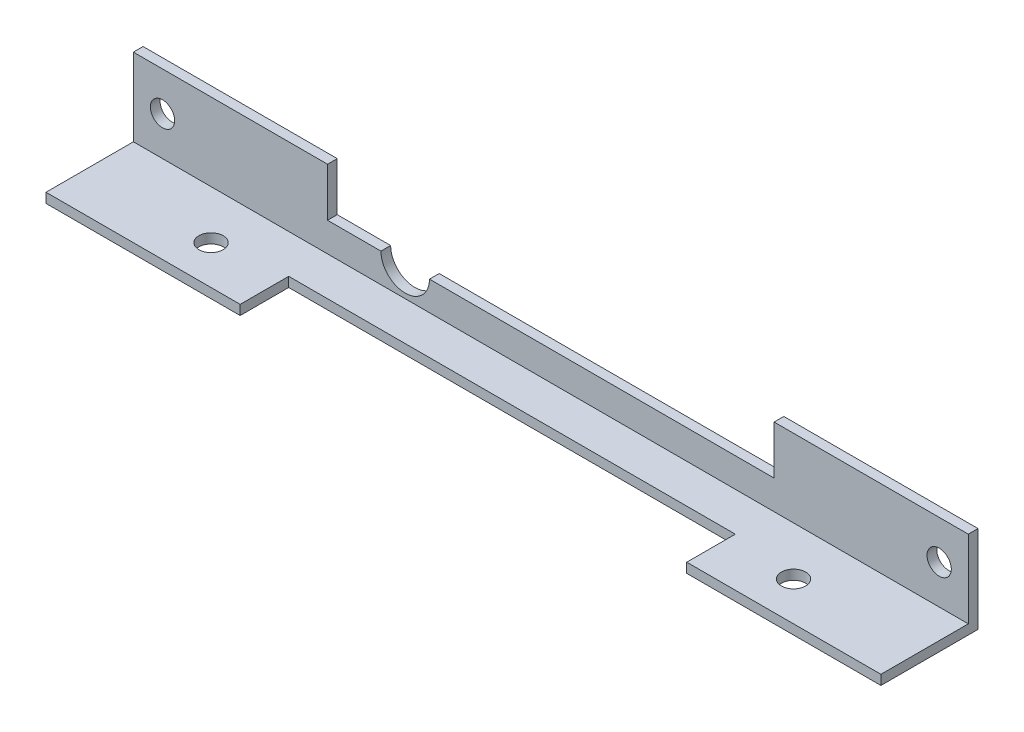
ISO-10303-21;
HEADER;
FILE_DESCRIPTION(('STEP AP214'),'2;1');
FILE_NAME('part.step','',(''),(''),'','','');
FILE_SCHEMA(('AUTOMOTIVE_DESIGN { 1 0 10303 214 1 1 1 1 }'));
ENDSEC;
DATA;
#1=APPLICATION_CONTEXT('core data for automotive mechanical design processes');
#2=APPLICATION_PROTOCOL_DEFINITION('international standard','automotive_design',2000,#1);
#3=PRODUCT_CONTEXT('',#1,'mechanical');
#4=PRODUCT('Part','Part','',(#3));
#5=PRODUCT_RELATED_PRODUCT_CATEGORY('part','',(#4));
#6=PRODUCT_DEFINITION_FORMATION('','',#4);
#7=PRODUCT_DEFINITION_CONTEXT('part definition',#1,'design');
#8=PRODUCT_DEFINITION('design','',#6,#7);
#9=PRODUCT_DEFINITION_SHAPE('','',#8);
#10=(LENGTH_UNIT() NAMED_UNIT(*) SI_UNIT(.MILLI.,.METRE.));
#11=(NAMED_UNIT(*) PLANE_ANGLE_UNIT() SI_UNIT($,.RADIAN.));
#12=(NAMED_UNIT(*) SI_UNIT($,.STERADIAN.) SOLID_ANGLE_UNIT());
#13=UNCERTAINTY_MEASURE_WITH_UNIT(LENGTH_MEASURE(1.E-05),#10,'distance_accuracy_value','');
#14=(GEOMETRIC_REPRESENTATION_CONTEXT(3) GLOBAL_UNCERTAINTY_ASSIGNED_CONTEXT((#13)) GLOBAL_UNIT_ASSIGNED_CONTEXT((#10,
#11,#12)) REPRESENTATION_CONTEXT('',''));
#15=CARTESIAN_POINT('',(0.,0.,0.));
#16=DIRECTION('',(0.,0.,1.));
#17=DIRECTION('',(1.,0.,0.));
#18=AXIS2_PLACEMENT_3D('',#15,#16,#17);
#19=CARTESIAN_POINT('',(-54.256880733945,4.,-19.8715596330275));
#20=DIRECTION('',(0.,-1.,0.));
#21=DIRECTION('',(0.,0.,-1.));
#22=AXIS2_PLACEMENT_3D('',#19,#20,#21);
#23=PLANE('',#22);
#24=DIRECTION('',(1.,0.,0.));
#25=VECTOR('',#24,1.);
#26=CARTESIAN_POINT('',(-74.256880733945,4.,-10.8715596330275));
#27=LINE('',#26,#25);
#28=CARTESIAN_POINT('',(-43.756880733945,4.,-10.8715596330275));
#29=VERTEX_POINT('',#28);
#30=CARTESIAN_POINT('',(-8.25688073394496,4.,-10.8715596330275));
#31=VERTEX_POINT('',#30);
#32=EDGE_CURVE('E164',#29,#31,#27,.T.);
#33=ORIENTED_EDGE('',*,*,#32,.F.);
#34=DIRECTION('',(0.,0.,1.));
#35=VECTOR('',#34,1.);
#36=CARTESIAN_POINT('',(-43.756880733945,4.,-19.8715596330275));
#37=LINE('',#36,#35);
#38=CARTESIAN_POINT('',(-43.756880733945,4.,-9.87155963302751));
#39=VERTEX_POINT('',#38);
#40=EDGE_CURVE('E11',#29,#39,#37,.T.);
#41=ORIENTED_EDGE('',*,*,#40,.T.);
#42=DIRECTION('',(1.,0.,0.));
#43=VECTOR('',#42,1.);
#44=CARTESIAN_POINT('',(-54.256880733945,4.,-9.87155963302751));
#45=LINE('',#44,#43);
#46=CARTESIAN_POINT('',(-8.25688073394496,4.,-9.87155963302751));
#47=VERTEX_POINT('',#46);
#48=EDGE_CURVE('E163',#39,#47,#45,.T.);
#49=ORIENTED_EDGE('',*,*,#48,.T.);
#50=DIRECTION('',(0.,0.,1.));
#51=VECTOR('',#50,1.);
#52=CARTESIAN_POINT('',(-8.25688073394496,4.,-19.8715596330275));
#53=LINE('',#52,#51);
#54=EDGE_CURVE('E181',#31,#47,#53,.T.);
#55=ORIENTED_EDGE('',*,*,#54,.F.);
#56=EDGE_LOOP('',(#33,#41,#49,#55));
#57=FACE_BOUND('',#56,.T.);
#58=ADVANCED_FACE('F39',(#57),#23,.F.);
#59=CARTESIAN_POINT('',(0.,9.,0.));
#60=DIRECTION('',(0.,1.,0.));
#61=DIRECTION('',(0.,0.,1.));
#62=AXIS2_PLACEMENT_3D('',#59,#60,#61);
#63=PLANE('',#62);
#64=DIRECTION('',(0.,0.,1.));
#65=VECTOR('',#64,1.);
#66=CARTESIAN_POINT('',(-54.256880733945,9.,0.));
#67=LINE('',#66,#65);
#68=CARTESIAN_POINT('',(-54.256880733945,9.,-10.8715596330275));
#69=VERTEX_POINT('',#68);
#70=CARTESIAN_POINT('',(-54.256880733945,9.,-9.87155963302751));
#71=VERTEX_POINT('',#70);
#72=EDGE_CURVE('E341',#69,#71,#67,.T.);
#73=ORIENTED_EDGE('',*,*,#72,.F.);
#74=DIRECTION('',(-1.,0.,0.));
#75=VECTOR('',#74,1.);
#76=CARTESIAN_POINT('',(-74.256880733945,9.,-10.8715596330275));
#77=LINE('',#76,#75);
#78=CARTESIAN_POINT('',(-74.256880733945,9.,-10.8715596330275));
#79=VERTEX_POINT('',#78);
#80=EDGE_CURVE('E262',#69,#79,#77,.T.);
#81=ORIENTED_EDGE('',*,*,#80,.T.);
#82=DIRECTION('',(0.,0.,1.));
#83=VECTOR('',#82,1.);
#84=CARTESIAN_POINT('',(-74.256880733945,9.,-10.8715596330275));
#85=LINE('',#84,#83);
#86=CARTESIAN_POINT('',(-74.256880733945,9.,-9.87155963302751));
#87=VERTEX_POINT('',#86);
#88=EDGE_CURVE('E249',#79,#87,#85,.T.);
#89=ORIENTED_EDGE('',*,*,#88,.T.);
#90=DIRECTION('',(1.,0.,0.));
#91=VECTOR('',#90,1.);
#92=CARTESIAN_POINT('',(-74.256880733945,9.,-9.87155963302751));
#93=LINE('',#92,#91);
#94=EDGE_CURVE('E254',#87,#71,#93,.T.);
#95=ORIENTED_EDGE('',*,*,#94,.T.);
#96=EDGE_LOOP('',(#73,#81,#89,#95));
#97=FACE_BOUND('',#96,.T.);
#98=ADVANCED_FACE('F358',(#97),#63,.T.);
#99=CARTESIAN_POINT('',(-74.256880733945,1.,-0.871559633027515));
#100=DIRECTION('',(0.,0.,-1.));
#101=DIRECTION('',(-1.,0.,0.));
#102=AXIS2_PLACEMENT_3D('',#99,#100,#101);
#103=PLANE('',#102);
#104=DIRECTION('',(1.,0.,0.));
#105=VECTOR('',#104,1.);
#106=CARTESIAN_POINT('',(-74.256880733945,0.,-0.871559633027515));
#107=LINE('',#106,#105);
#108=CARTESIAN_POINT('',(-74.256880733945,0.,-0.871559633027515));
#109=VERTEX_POINT('',#108);
#110=CARTESIAN_POINT('',(-54.256880733945,0.,-0.871559633027515));
#111=VERTEX_POINT('',#110);
#112=EDGE_CURVE('E296',#109,#111,#107,.T.);
#113=ORIENTED_EDGE('',*,*,#112,.T.);
#114=DIRECTION('',(0.,1.,0.));
#115=VECTOR('',#114,1.);
#116=CARTESIAN_POINT('',(-54.256880733945,-9.,-0.871559633027515));
#117=LINE('',#116,#115);
#118=CARTESIAN_POINT('',(-54.256880733945,1.,-0.871559633027515));
#119=VERTEX_POINT('',#118);
#120=EDGE_CURVE('E209',#111,#119,#117,.T.);
#121=ORIENTED_EDGE('',*,*,#120,.T.);
#122=DIRECTION('',(1.,0.,0.));
#123=VECTOR('',#122,1.);
#124=CARTESIAN_POINT('',(-74.256880733945,1.,-0.871559633027515));
#125=LINE('',#124,#123);
#126=CARTESIAN_POINT('',(-74.256880733945,1.,-0.871559633027515));
#127=VERTEX_POINT('',#126);
#128=EDGE_CURVE('E284',#127,#119,#125,.T.);
#129=ORIENTED_EDGE('',*,*,#128,.F.);
#130=DIRECTION('',(0.,-1.,0.));
#131=VECTOR('',#130,1.);
#132=CARTESIAN_POINT('',(-74.256880733945,1.,-0.871559633027515));
#133=LINE('',#132,#131);
#134=EDGE_CURVE('E316',#127,#109,#133,.T.);
#135=ORIENTED_EDGE('',*,*,#134,.T.);
#136=EDGE_LOOP('',(#113,#121,#129,#135));
#137=FACE_BOUND('',#136,.T.);
#138=ADVANCED_FACE('F371',(#137),#103,.F.);
#139=CARTESIAN_POINT('',(-74.256880733945,1.,-10.8715596330275));
#140=DIRECTION('',(1.,0.,0.));
#141=DIRECTION('',(0.,0.,-1.));
#142=AXIS2_PLACEMENT_3D('',#139,#140,#141);
#143=PLANE('',#142);
#144=DIRECTION('',(0.,0.,1.));
#145=VECTOR('',#144,1.);
#146=CARTESIAN_POINT('',(-74.256880733945,0.,-10.8715596330275));
#147=LINE('',#146,#145);
#148=CARTESIAN_POINT('',(-74.256880733945,0.,-10.8715596330275));
#149=VERTEX_POINT('',#148);
#150=EDGE_CURVE('E278',#149,#109,#147,.T.);
#151=ORIENTED_EDGE('',*,*,#150,.T.);
#152=ORIENTED_EDGE('',*,*,#134,.F.);
#153=DIRECTION('',(0.,0.,1.));
#154=VECTOR('',#153,1.);
#155=CARTESIAN_POINT('',(-74.256880733945,1.,-10.8715596330275));
#156=LINE('',#155,#154);
#157=CARTESIAN_POINT('',(-74.256880733945,1.,-9.87155963302751));
#158=VERTEX_POINT('',#157);
#159=EDGE_CURVE('E279',#158,#127,#156,.T.);
#160=ORIENTED_EDGE('',*,*,#159,.F.);
#161=DIRECTION('',(0.,-1.,0.));
#162=VECTOR('',#161,1.);
#163=CARTESIAN_POINT('',(-74.256880733945,9.,-9.87155963302751));
#164=LINE('',#163,#162);
#165=EDGE_CURVE('E274',#87,#158,#164,.T.);
#166=ORIENTED_EDGE('',*,*,#165,.F.);
#167=ORIENTED_EDGE('',*,*,#88,.F.);
#168=DIRECTION('',(0.,-1.,0.));
#169=VECTOR('',#168,1.);
#170=CARTESIAN_POINT('',(-74.256880733945,1.,-10.8715596330275));
#171=LINE('',#170,#169);
#172=EDGE_CURVE('E291',#79,#149,#171,.T.);
#173=ORIENTED_EDGE('',*,*,#172,.T.);
#174=EDGE_LOOP('',(#151,#152,#160,#166,#167,#173));
#175=FACE_BOUND('',#174,.T.);
#176=ADVANCED_FACE('F41',(#175),#143,.F.);
#177=CARTESIAN_POINT('',(-8.25688073394496,1.,-0.871559633027515));
#178=VERTEX_POINT('',#177);
#179=CARTESIAN_POINT('',(11.743119266055,1.,-0.871559633027515));
#180=VERTEX_POINT('',#179);
#181=EDGE_CURVE('E282',#178,#180,#125,.T.);
#182=ORIENTED_EDGE('',*,*,#181,.F.);
#183=DIRECTION('',(0.,1.,0.));
#184=VECTOR('',#183,1.);
#185=CARTESIAN_POINT('',(-8.25688073394496,-9.,-0.871559633027515));
#186=LINE('',#185,#184);
#187=CARTESIAN_POINT('',(-8.25688073394496,0.,-0.871559633027515));
#188=VERTEX_POINT('',#187);
#189=EDGE_CURVE('E217',#188,#178,#186,.T.);
#190=ORIENTED_EDGE('',*,*,#189,.F.);
#191=CARTESIAN_POINT('',(11.743119266055,0.,-0.871559633027515));
#192=VERTEX_POINT('',#191);
#193=EDGE_CURVE('E295',#188,#192,#107,.T.);
#194=ORIENTED_EDGE('',*,*,#193,.T.);
#195=DIRECTION('',(0.,-1.,0.));
#196=VECTOR('',#195,1.);
#197=CARTESIAN_POINT('',(11.743119266055,1.,-0.871559633027515));
#198=LINE('',#197,#196);
#199=EDGE_CURVE('E312',#180,#192,#198,.T.);
#200=ORIENTED_EDGE('',*,*,#199,.F.);
#201=EDGE_LOOP('',(#182,#190,#194,#200));
#202=FACE_BOUND('',#201,.T.);
#203=ADVANCED_FACE('F389',(#202),#103,.F.);
#204=CARTESIAN_POINT('',(11.743119266055,1.,-10.8715596330275));
#205=DIRECTION('',(-1.,0.,0.));
#206=DIRECTION('',(0.,0.,1.));
#207=AXIS2_PLACEMENT_3D('',#204,#205,#206);
#208=PLANE('',#207);
#209=DIRECTION('',(0.,0.,-1.));
#210=VECTOR('',#209,1.);
#211=CARTESIAN_POINT('',(11.743119266055,0.,-10.8715596330275));
#212=LINE('',#211,#210);
#213=CARTESIAN_POINT('',(11.743119266055,0.,-10.8715596330275));
#214=VERTEX_POINT('',#213);
#215=EDGE_CURVE('E300',#192,#214,#212,.T.);
#216=ORIENTED_EDGE('',*,*,#215,.T.);
#217=DIRECTION('',(0.,-1.,0.));
#218=VECTOR('',#217,1.);
#219=CARTESIAN_POINT('',(11.743119266055,1.,-10.8715596330275));
#220=LINE('',#219,#218);
#221=CARTESIAN_POINT('',(11.743119266055,9.,-10.8715596330275));
#222=VERTEX_POINT('',#221);
#223=EDGE_CURVE('E308',#222,#214,#220,.T.);
#224=ORIENTED_EDGE('',*,*,#223,.F.);
#225=DIRECTION('',(0.,0.,-1.));
#226=VECTOR('',#225,1.);
#227=CARTESIAN_POINT('',(11.743119266055,9.,-10.8715596330275));
#228=LINE('',#227,#226);
#229=CARTESIAN_POINT('',(11.743119266055,9.,-9.87155963302751));
#230=VERTEX_POINT('',#229);
#231=EDGE_CURVE('E258',#230,#222,#228,.T.);
#232=ORIENTED_EDGE('',*,*,#231,.F.);
#233=DIRECTION('',(0.,-1.,0.));
#234=VECTOR('',#233,1.);
#235=CARTESIAN_POINT('',(11.743119266055,9.,-9.87155963302751));
#236=LINE('',#235,#234);
#237=CARTESIAN_POINT('',(11.743119266055,1.,-9.87155963302751));
#238=VERTEX_POINT('',#237);
#239=EDGE_CURVE('E267',#230,#238,#236,.T.);
#240=ORIENTED_EDGE('',*,*,#239,.T.);
#241=DIRECTION('',(0.,0.,-1.));
#242=VECTOR('',#241,1.);
#243=CARTESIAN_POINT('',(11.743119266055,1.,-10.8715596330275));
#244=LINE('',#243,#242);
#245=EDGE_CURVE('E288',#180,#238,#244,.T.);
#246=ORIENTED_EDGE('',*,*,#245,.F.);
#247=ORIENTED_EDGE('',*,*,#199,.T.);
#248=EDGE_LOOP('',(#216,#224,#232,#240,#246,#247));
#249=FACE_BOUND('',#248,.T.);
#250=ADVANCED_FACE('F443',(#249),#208,.F.);
#251=CARTESIAN_POINT('',(-74.256880733945,1.,-10.8715596330275));
#252=DIRECTION('',(0.,0.,1.));
#253=DIRECTION('',(1.,0.,0.));
#254=AXIS2_PLACEMENT_3D('',#251,#252,#253);
#255=PLANE('',#254);
#256=CARTESIAN_POINT('',(-54.256880733945,4.,-10.8715596330275));
#257=VERTEX_POINT('',#256);
#258=CARTESIAN_POINT('',(-48.756880733945,4.,-10.8715596330275));
#259=VERTEX_POINT('',#258);
#260=EDGE_CURVE('E194',#257,#259,#27,.T.);
#261=ORIENTED_EDGE('',*,*,#260,.T.);
#262=CARTESIAN_POINT('',(-46.256880733945,4.,-10.8715596330275));
#263=DIRECTION('',(0.,0.,1.));
#264=DIRECTION('',(1.,0.,0.));
#265=AXIS2_PLACEMENT_3D('',#262,#263,#264);
#266=CIRCLE('',#265,2.5);
#267=EDGE_CURVE('E55',#259,#29,#266,.T.);
#268=ORIENTED_EDGE('',*,*,#267,.T.);
#269=ORIENTED_EDGE('',*,*,#32,.T.);
#270=DIRECTION('',(0.,1.,0.));
#271=VECTOR('',#270,1.);
#272=CARTESIAN_POINT('',(-8.25688073394496,1.,-10.8715596330275));
#273=LINE('',#272,#271);
#274=CARTESIAN_POINT('',(-8.25688073394496,9.,-10.8715596330275));
#275=VERTEX_POINT('',#274);
#276=EDGE_CURVE('E184',#31,#275,#273,.T.);
#277=ORIENTED_EDGE('',*,*,#276,.T.);
#278=EDGE_CURVE('E263',#222,#275,#77,.T.);
#279=ORIENTED_EDGE('',*,*,#278,.F.);
#280=ORIENTED_EDGE('',*,*,#223,.T.);
#281=DIRECTION('',(-1.,0.,0.));
#282=VECTOR('',#281,1.);
#283=CARTESIAN_POINT('',(-74.256880733945,0.,-10.8715596330275));
#284=LINE('',#283,#282);
#285=EDGE_CURVE('E283',#214,#149,#284,.T.);
#286=ORIENTED_EDGE('',*,*,#285,.T.);
#287=ORIENTED_EDGE('',*,*,#172,.F.);
#288=ORIENTED_EDGE('',*,*,#80,.F.);
#289=DIRECTION('',(0.,-1.,0.));
#290=VECTOR('',#289,1.);
#291=CARTESIAN_POINT('',(-54.256880733945,0.999999999999972,-10.8715596330275));
#292=LINE('',#291,#290);
#293=EDGE_CURVE('E190',#69,#257,#292,.T.);
#294=ORIENTED_EDGE('',*,*,#293,.T.);
#295=EDGE_LOOP('',(#261,#268,#269,#277,#279,#280,#286,#287,#288,#294));
#296=FACE_BOUND('',#295,.T.);
#297=CARTESIAN_POINT('',(8.74311926605504,5.,-10.8715596330275));
#298=DIRECTION('',(0.,0.,1.));
#299=DIRECTION('',(1.,0.,0.));
#300=AXIS2_PLACEMENT_3D('',#297,#298,#299);
#301=CIRCLE('',#300,1.25);
#302=CARTESIAN_POINT('',(9.99311926605504,5.,-10.8715596330275));
#303=VERTEX_POINT('',#302);
#304=EDGE_CURVE('E244',#303,#303,#301,.T.);
#305=ORIENTED_EDGE('',*,*,#304,.T.);
#306=EDGE_LOOP('',(#305));
#307=FACE_BOUND('',#306,.T.);
#308=CARTESIAN_POINT('',(-71.256880733945,5.,-10.8715596330275));
#309=DIRECTION('',(0.,0.,1.));
#310=DIRECTION('',(1.,0.,0.));
#311=AXIS2_PLACEMENT_3D('',#308,#309,#310);
#312=CIRCLE('',#311,1.25);
#313=CARTESIAN_POINT('',(-70.006880733945,5.,-10.8715596330275));
#314=VERTEX_POINT('',#313);
#315=EDGE_CURVE('E235',#314,#314,#312,.T.);
#316=ORIENTED_EDGE('',*,*,#315,.T.);
#317=EDGE_LOOP('',(#316));
#318=FACE_BOUND('',#317,.T.);
#319=ADVANCED_FACE('F349',(#296,#307,#318),#255,.F.);
#320=CARTESIAN_POINT('',(0.,1.,0.));
#321=DIRECTION('',(0.,1.,0.));
#322=DIRECTION('',(0.,0.,1.));
#323=AXIS2_PLACEMENT_3D('',#320,#321,#322);
#324=PLANE('',#323);
#325=DIRECTION('',(0.,0.,1.));
#326=VECTOR('',#325,1.);
#327=CARTESIAN_POINT('',(-54.256880733945,1.,-5.87155963302752));
#328=LINE('',#327,#326);
#329=CARTESIAN_POINT('',(-54.256880733945,1.,-5.87155963302752));
#330=VERTEX_POINT('',#329);
#331=EDGE_CURVE('E198',#330,#119,#328,.T.);
#332=ORIENTED_EDGE('',*,*,#331,.F.);
#333=DIRECTION('',(-1.,0.,0.));
#334=VECTOR('',#333,1.);
#335=CARTESIAN_POINT('',(-54.256880733945,1.,-5.87155963302752));
#336=LINE('',#335,#334);
#337=CARTESIAN_POINT('',(-8.25688073394496,1.,-5.87155963302752));
#338=VERTEX_POINT('',#337);
#339=EDGE_CURVE('E205',#338,#330,#336,.T.);
#340=ORIENTED_EDGE('',*,*,#339,.F.);
#341=DIRECTION('',(0.,0.,-1.));
#342=VECTOR('',#341,1.);
#343=CARTESIAN_POINT('',(-8.25688073394496,1.,-5.87155963302752));
#344=LINE('',#343,#342);
#345=EDGE_CURVE('E201',#178,#338,#344,.T.);
#346=ORIENTED_EDGE('',*,*,#345,.F.);
#347=ORIENTED_EDGE('',*,*,#181,.T.);
#348=ORIENTED_EDGE('',*,*,#245,.T.);
#349=DIRECTION('',(1.,0.,0.));
#350=VECTOR('',#349,1.);
#351=CARTESIAN_POINT('',(-74.256880733945,1.,-9.87155963302751));
#352=LINE('',#351,#350);
#353=EDGE_CURVE('E248',#158,#238,#352,.T.);
#354=ORIENTED_EDGE('',*,*,#353,.F.);
#355=ORIENTED_EDGE('',*,*,#159,.T.);
#356=ORIENTED_EDGE('',*,*,#128,.T.);
#357=EDGE_LOOP('',(#332,#340,#346,#347,#348,#354,#355,#356));
#358=FACE_BOUND('',#357,.T.);
#359=CARTESIAN_POINT('',(-61.256880733945,1.,-4.87155963302752));
#360=DIRECTION('',(0.,1.,0.));
#361=DIRECTION('',(0.,0.,1.));
#362=AXIS2_PLACEMENT_3D('',#359,#360,#361);
#363=CIRCLE('',#362,1.25);
#364=CARTESIAN_POINT('',(-61.256880733945,1.,-3.62155963302752));
#365=VERTEX_POINT('',#364);
#366=EDGE_CURVE('E223',#365,#365,#363,.T.);
#367=ORIENTED_EDGE('',*,*,#366,.F.);
#368=EDGE_LOOP('',(#367));
#369=FACE_BOUND('',#368,.T.);
#370=CARTESIAN_POINT('',(-1.25688073394496,1.,-4.87155963302752));
#371=DIRECTION('',(0.,1.,0.));
#372=DIRECTION('',(0.,0.,1.));
#373=AXIS2_PLACEMENT_3D('',#370,#371,#372);
#374=CIRCLE('',#373,1.25);
#375=CARTESIAN_POINT('',(-1.25688073394496,1.,-3.62155963302751));
#376=VERTEX_POINT('',#375);
#377=EDGE_CURVE('E213',#376,#376,#374,.T.);
#378=ORIENTED_EDGE('',*,*,#377,.F.);
#379=EDGE_LOOP('',(#378));
#380=FACE_BOUND('',#379,.T.);
#381=ADVANCED_FACE('F368',(#358,#369,#380),#324,.T.);
#382=CARTESIAN_POINT('',(0.,0.,0.));
#383=DIRECTION('',(0.,1.,0.));
#384=DIRECTION('',(0.,0.,1.));
#385=AXIS2_PLACEMENT_3D('',#382,#383,#384);
#386=PLANE('',#385);
#387=CARTESIAN_POINT('',(-61.256880733945,0.,-4.87155963302752));
#388=DIRECTION('',(0.,1.,0.));
#389=DIRECTION('',(0.,0.,1.));
#390=AXIS2_PLACEMENT_3D('',#387,#388,#389);
#391=CIRCLE('',#390,1.25);
#392=CARTESIAN_POINT('',(-61.256880733945,0.,-3.62155963302752));
#393=VERTEX_POINT('',#392);
#394=EDGE_CURVE('E240',#393,#393,#391,.T.);
#395=ORIENTED_EDGE('',*,*,#394,.T.);
#396=EDGE_LOOP('',(#395));
#397=FACE_BOUND('',#396,.T.);
#398=CARTESIAN_POINT('',(-1.25688073394496,0.,-4.87155963302752));
#399=DIRECTION('',(0.,1.,0.));
#400=DIRECTION('',(0.,0.,1.));
#401=AXIS2_PLACEMENT_3D('',#398,#399,#400);
#402=CIRCLE('',#401,1.25);
#403=CARTESIAN_POINT('',(-1.25688073394496,0.,-3.62155963302751));
#404=VERTEX_POINT('',#403);
#405=EDGE_CURVE('E227',#404,#404,#402,.T.);
#406=ORIENTED_EDGE('',*,*,#405,.T.);
#407=EDGE_LOOP('',(#406));
#408=FACE_BOUND('',#407,.T.);
#409=DIRECTION('',(-1.,0.,0.));
#410=VECTOR('',#409,1.);
#411=CARTESIAN_POINT('',(0.,0.,-5.87155963302752));
#412=LINE('',#411,#410);
#413=CARTESIAN_POINT('',(-8.25688073394496,0.,-5.87155963302752));
#414=VERTEX_POINT('',#413);
#415=CARTESIAN_POINT('',(-54.256880733945,0.,-5.87155963302752));
#416=VERTEX_POINT('',#415);
#417=EDGE_CURVE('E330',#414,#416,#412,.T.);
#418=ORIENTED_EDGE('',*,*,#417,.T.);
#419=DIRECTION('',(0.,0.,1.));
#420=VECTOR('',#419,1.);
#421=CARTESIAN_POINT('',(-54.256880733945,0.,0.));
#422=LINE('',#421,#420);
#423=EDGE_CURVE('E334',#416,#111,#422,.T.);
#424=ORIENTED_EDGE('',*,*,#423,.T.);
#425=ORIENTED_EDGE('',*,*,#112,.F.);
#426=ORIENTED_EDGE('',*,*,#150,.F.);
#427=ORIENTED_EDGE('',*,*,#285,.F.);
#428=ORIENTED_EDGE('',*,*,#215,.F.);
#429=ORIENTED_EDGE('',*,*,#193,.F.);
#430=DIRECTION('',(0.,0.,-1.));
#431=VECTOR('',#430,1.);
#432=CARTESIAN_POINT('',(-8.25688073394496,0.,0.));
#433=LINE('',#432,#431);
#434=EDGE_CURVE('E320',#188,#414,#433,.T.);
#435=ORIENTED_EDGE('',*,*,#434,.T.);
#436=EDGE_LOOP('',(#418,#424,#425,#426,#427,#428,#429,#435));
#437=FACE_BOUND('',#436,.T.);
#438=ADVANCED_FACE('F376',(#397,#408,#437),#386,.F.);
#439=CARTESIAN_POINT('',(-74.256880733945,9.,-9.87155963302751));
#440=DIRECTION('',(0.,0.,-1.));
#441=DIRECTION('',(-1.,0.,0.));
#442=AXIS2_PLACEMENT_3D('',#439,#440,#441);
#443=PLANE('',#442);
#444=CARTESIAN_POINT('',(8.74311926605504,5.,-9.87155963302751));
#445=DIRECTION('',(0.,0.,1.));
#446=DIRECTION('',(1.,0.,0.));
#447=AXIS2_PLACEMENT_3D('',#444,#445,#446);
#448=CIRCLE('',#447,1.25);
#449=CARTESIAN_POINT('',(9.99311926605504,5.,-9.87155963302751));
#450=VERTEX_POINT('',#449);
#451=EDGE_CURVE('E231',#450,#450,#448,.T.);
#452=ORIENTED_EDGE('',*,*,#451,.F.);
#453=EDGE_LOOP('',(#452));
#454=FACE_BOUND('',#453,.T.);
#455=CARTESIAN_POINT('',(-71.256880733945,5.,-9.87155963302751));
#456=DIRECTION('',(0.,0.,1.));
#457=DIRECTION('',(1.,0.,0.));
#458=AXIS2_PLACEMENT_3D('',#455,#456,#457);
#459=CIRCLE('',#458,1.25);
#460=CARTESIAN_POINT('',(-70.006880733945,5.,-9.87155963302751));
#461=VERTEX_POINT('',#460);
#462=EDGE_CURVE('E236',#461,#461,#459,.T.);
#463=ORIENTED_EDGE('',*,*,#462,.F.);
#464=EDGE_LOOP('',(#463));
#465=FACE_BOUND('',#464,.T.);
#466=ORIENTED_EDGE('',*,*,#48,.F.);
#467=CARTESIAN_POINT('',(-46.256880733945,4.,-9.87155963302751));
#468=DIRECTION('',(0.,0.,1.));
#469=DIRECTION('',(1.,0.,0.));
#470=AXIS2_PLACEMENT_3D('',#467,#468,#469);
#471=CIRCLE('',#470,2.5);
#472=CARTESIAN_POINT('',(-48.756880733945,4.,-9.87155963302751));
#473=VERTEX_POINT('',#472);
#474=EDGE_CURVE('E152',#473,#39,#471,.T.);
#475=ORIENTED_EDGE('',*,*,#474,.F.);
#476=CARTESIAN_POINT('',(-54.256880733945,4.,-9.87155963302751));
#477=VERTEX_POINT('',#476);
#478=EDGE_CURVE('E168',#477,#473,#45,.T.);
#479=ORIENTED_EDGE('',*,*,#478,.F.);
#480=DIRECTION('',(0.,-1.,0.));
#481=VECTOR('',#480,1.);
#482=CARTESIAN_POINT('',(-54.256880733945,9.,-9.87155963302751));
#483=LINE('',#482,#481);
#484=EDGE_CURVE('E169',#71,#477,#483,.T.);
#485=ORIENTED_EDGE('',*,*,#484,.F.);
#486=ORIENTED_EDGE('',*,*,#94,.F.);
#487=ORIENTED_EDGE('',*,*,#165,.T.);
#488=ORIENTED_EDGE('',*,*,#353,.T.);
#489=ORIENTED_EDGE('',*,*,#239,.F.);
#490=CARTESIAN_POINT('',(-8.25688073394496,9.,-9.87155963302751));
#491=VERTEX_POINT('',#490);
#492=EDGE_CURVE('E253',#491,#230,#93,.T.);
#493=ORIENTED_EDGE('',*,*,#492,.F.);
#494=DIRECTION('',(0.,1.,0.));
#495=VECTOR('',#494,1.);
#496=CARTESIAN_POINT('',(-8.25688073394496,9.,-9.87155963302751));
#497=LINE('',#496,#495);
#498=EDGE_CURVE('E63',#47,#491,#497,.T.);
#499=ORIENTED_EDGE('',*,*,#498,.F.);
#500=EDGE_LOOP('',(#466,#475,#479,#485,#486,#487,#488,#489,#493,#499));
#501=FACE_BOUND('',#500,.T.);
#502=ADVANCED_FACE('F165',(#454,#465,#501),#443,.F.);
#503=DIRECTION('',(0.,0.,-1.));
#504=VECTOR('',#503,1.);
#505=CARTESIAN_POINT('',(-8.25688073394496,9.,0.));
#506=LINE('',#505,#504);
#507=EDGE_CURVE('E338',#491,#275,#506,.T.);
#508=ORIENTED_EDGE('',*,*,#507,.F.);
#509=ORIENTED_EDGE('',*,*,#492,.T.);
#510=ORIENTED_EDGE('',*,*,#231,.T.);
#511=ORIENTED_EDGE('',*,*,#278,.T.);
#512=EDGE_LOOP('',(#508,#509,#510,#511));
#513=FACE_BOUND('',#512,.T.);
#514=ADVANCED_FACE('F440',(#513),#63,.T.);
#515=CARTESIAN_POINT('',(-71.256880733945,5.,-19.8715596330275));
#516=DIRECTION('',(0.,0.,1.));
#517=DIRECTION('',(1.,0.,0.));
#518=AXIS2_PLACEMENT_3D('',#515,#516,#517);
#519=CYLINDRICAL_SURFACE('',#518,1.25);
#520=ORIENTED_EDGE('',*,*,#462,.T.);
#521=EDGE_LOOP('',(#520));
#522=FACE_BOUND('',#521,.T.);
#523=ORIENTED_EDGE('',*,*,#315,.F.);
#524=EDGE_LOOP('',(#523));
#525=FACE_BOUND('',#524,.T.);
#526=ADVANCED_FACE('F486',(#522,#525),#519,.F.);
#527=CARTESIAN_POINT('',(8.74311926605504,5.,-19.8715596330275));
#528=DIRECTION('',(0.,0.,1.));
#529=DIRECTION('',(1.,0.,0.));
#530=AXIS2_PLACEMENT_3D('',#527,#528,#529);
#531=CYLINDRICAL_SURFACE('',#530,1.25);
#532=ORIENTED_EDGE('',*,*,#451,.T.);
#533=EDGE_LOOP('',(#532));
#534=FACE_BOUND('',#533,.T.);
#535=ORIENTED_EDGE('',*,*,#304,.F.);
#536=EDGE_LOOP('',(#535));
#537=FACE_BOUND('',#536,.T.);
#538=ADVANCED_FACE('F482',(#534,#537),#531,.F.);
#539=CARTESIAN_POINT('',(-1.25688073394496,-9.,-4.87155963302752));
#540=DIRECTION('',(0.,1.,0.));
#541=DIRECTION('',(0.,0.,1.));
#542=AXIS2_PLACEMENT_3D('',#539,#540,#541);
#543=CYLINDRICAL_SURFACE('',#542,1.25);
#544=ORIENTED_EDGE('',*,*,#377,.T.);
#545=EDGE_LOOP('',(#544));
#546=FACE_BOUND('',#545,.T.);
#547=ORIENTED_EDGE('',*,*,#405,.F.);
#548=EDGE_LOOP('',(#547));
#549=FACE_BOUND('',#548,.T.);
#550=ADVANCED_FACE('F478',(#546,#549),#543,.F.);
#551=CARTESIAN_POINT('',(-61.256880733945,-9.,-4.87155963302752));
#552=DIRECTION('',(0.,1.,0.));
#553=DIRECTION('',(0.,0.,1.));
#554=AXIS2_PLACEMENT_3D('',#551,#552,#553);
#555=CYLINDRICAL_SURFACE('',#554,1.25);
#556=ORIENTED_EDGE('',*,*,#366,.T.);
#557=EDGE_LOOP('',(#556));
#558=FACE_BOUND('',#557,.T.);
#559=ORIENTED_EDGE('',*,*,#394,.F.);
#560=EDGE_LOOP('',(#559));
#561=FACE_BOUND('',#560,.T.);
#562=ADVANCED_FACE('F475',(#558,#561),#555,.F.);
#563=CARTESIAN_POINT('',(-54.256880733945,-9.,-5.87155963302752));
#564=DIRECTION('',(-1.,0.,0.));
#565=DIRECTION('',(0.,0.,1.));
#566=AXIS2_PLACEMENT_3D('',#563,#564,#565);
#567=PLANE('',#566);
#568=DIRECTION('',(0.,1.,0.));
#569=VECTOR('',#568,1.);
#570=CARTESIAN_POINT('',(-54.256880733945,-9.,-5.87155963302752));
#571=LINE('',#570,#569);
#572=EDGE_CURVE('E210',#416,#330,#571,.T.);
#573=ORIENTED_EDGE('',*,*,#572,.T.);
#574=ORIENTED_EDGE('',*,*,#331,.T.);
#575=ORIENTED_EDGE('',*,*,#120,.F.);
#576=ORIENTED_EDGE('',*,*,#423,.F.);
#577=EDGE_LOOP('',(#573,#574,#575,#576));
#578=FACE_BOUND('',#577,.T.);
#579=ADVANCED_FACE('F373',(#578),#567,.F.);
#580=CARTESIAN_POINT('',(-54.256880733945,-9.,-5.87155963302752));
#581=DIRECTION('',(0.,0.,-1.));
#582=DIRECTION('',(-1.,0.,0.));
#583=AXIS2_PLACEMENT_3D('',#580,#581,#582);
#584=PLANE('',#583);
#585=DIRECTION('',(0.,1.,0.));
#586=VECTOR('',#585,1.);
#587=CARTESIAN_POINT('',(-8.25688073394496,-9.,-5.87155963302752));
#588=LINE('',#587,#586);
#589=EDGE_CURVE('E214',#414,#338,#588,.T.);
#590=ORIENTED_EDGE('',*,*,#589,.T.);
#591=ORIENTED_EDGE('',*,*,#339,.T.);
#592=ORIENTED_EDGE('',*,*,#572,.F.);
#593=ORIENTED_EDGE('',*,*,#417,.F.);
#594=EDGE_LOOP('',(#590,#591,#592,#593));
#595=FACE_BOUND('',#594,.T.);
#596=ADVANCED_FACE('F381',(#595),#584,.F.);
#597=CARTESIAN_POINT('',(-8.25688073394496,-9.,-5.87155963302752));
#598=DIRECTION('',(1.,0.,0.));
#599=DIRECTION('',(0.,0.,-1.));
#600=AXIS2_PLACEMENT_3D('',#597,#598,#599);
#601=PLANE('',#600);
#602=ORIENTED_EDGE('',*,*,#189,.T.);
#603=ORIENTED_EDGE('',*,*,#345,.T.);
#604=ORIENTED_EDGE('',*,*,#589,.F.);
#605=ORIENTED_EDGE('',*,*,#434,.F.);
#606=EDGE_LOOP('',(#602,#603,#604,#605));
#607=FACE_BOUND('',#606,.T.);
#608=ADVANCED_FACE('F462',(#607),#601,.F.);
#609=ORIENTED_EDGE('',*,*,#478,.T.);
#610=DIRECTION('',(0.,0.,1.));
#611=VECTOR('',#610,1.);
#612=CARTESIAN_POINT('',(-48.756880733945,4.,-19.8715596330275));
#613=LINE('',#612,#611);
#614=EDGE_CURVE('E48',#473,#259,#613,.F.);
#615=ORIENTED_EDGE('',*,*,#614,.T.);
#616=ORIENTED_EDGE('',*,*,#260,.F.);
#617=DIRECTION('',(0.,0.,1.));
#618=VECTOR('',#617,1.);
#619=CARTESIAN_POINT('',(-54.256880733945,4.,-19.8715596330275));
#620=LINE('',#619,#618);
#621=EDGE_CURVE('E180',#257,#477,#620,.T.);
#622=ORIENTED_EDGE('',*,*,#621,.T.);
#623=EDGE_LOOP('',(#609,#615,#616,#622));
#624=FACE_BOUND('',#623,.T.);
#625=ADVANCED_FACE('F346',(#624),#23,.F.);
#626=CARTESIAN_POINT('',(-54.256880733945,9.,-19.8715596330275));
#627=DIRECTION('',(-1.,0.,0.));
#628=DIRECTION('',(0.,-1.,0.));
#629=AXIS2_PLACEMENT_3D('',#626,#627,#628);
#630=PLANE('',#629);
#631=ORIENTED_EDGE('',*,*,#72,.T.);
#632=ORIENTED_EDGE('',*,*,#484,.T.);
#633=ORIENTED_EDGE('',*,*,#621,.F.);
#634=ORIENTED_EDGE('',*,*,#293,.F.);
#635=EDGE_LOOP('',(#631,#632,#633,#634));
#636=FACE_BOUND('',#635,.T.);
#637=ADVANCED_FACE('F355',(#636),#630,.F.);
#638=CARTESIAN_POINT('',(-8.25688073394496,9.,-19.8715596330275));
#639=DIRECTION('',(1.,0.,0.));
#640=DIRECTION('',(0.,0.,-1.));
#641=AXIS2_PLACEMENT_3D('',#638,#639,#640);
#642=PLANE('',#641);
#643=ORIENTED_EDGE('',*,*,#54,.T.);
#644=ORIENTED_EDGE('',*,*,#498,.T.);
#645=ORIENTED_EDGE('',*,*,#507,.T.);
#646=ORIENTED_EDGE('',*,*,#276,.F.);
#647=EDGE_LOOP('',(#643,#644,#645,#646));
#648=FACE_BOUND('',#647,.T.);
#649=ADVANCED_FACE('F438',(#648),#642,.F.);
#650=CARTESIAN_POINT('',(-46.256880733945,4.,-19.8715596330275));
#651=DIRECTION('',(0.,0.,1.));
#652=DIRECTION('',(1.,0.,0.));
#653=AXIS2_PLACEMENT_3D('',#650,#651,#652);
#654=CYLINDRICAL_SURFACE('',#653,2.5);
#655=ORIENTED_EDGE('',*,*,#267,.F.);
#656=ORIENTED_EDGE('',*,*,#614,.F.);
#657=ORIENTED_EDGE('',*,*,#474,.T.);
#658=ORIENTED_EDGE('',*,*,#40,.F.);
#659=EDGE_LOOP('',(#655,#656,#657,#658));
#660=FACE_BOUND('',#659,.T.);
#661=ADVANCED_FACE('F153',(#660),#654,.F.);
#662=CLOSED_SHELL('',(#58,#98,#138,#176,#203,#250,#319,#381,#438,#502,#514,#526,#538,#550,#562,
#579,#596,#608,#625,#637,#649,#661));
#663=MANIFOLD_SOLID_BREP('B2',#662);
#664=ADVANCED_BREP_SHAPE_REPRESENTATION('',(#18,#663),#14);
#665=SHAPE_DEFINITION_REPRESENTATION(#9,#664);
ENDSEC;
END-ISO-10303-21;
